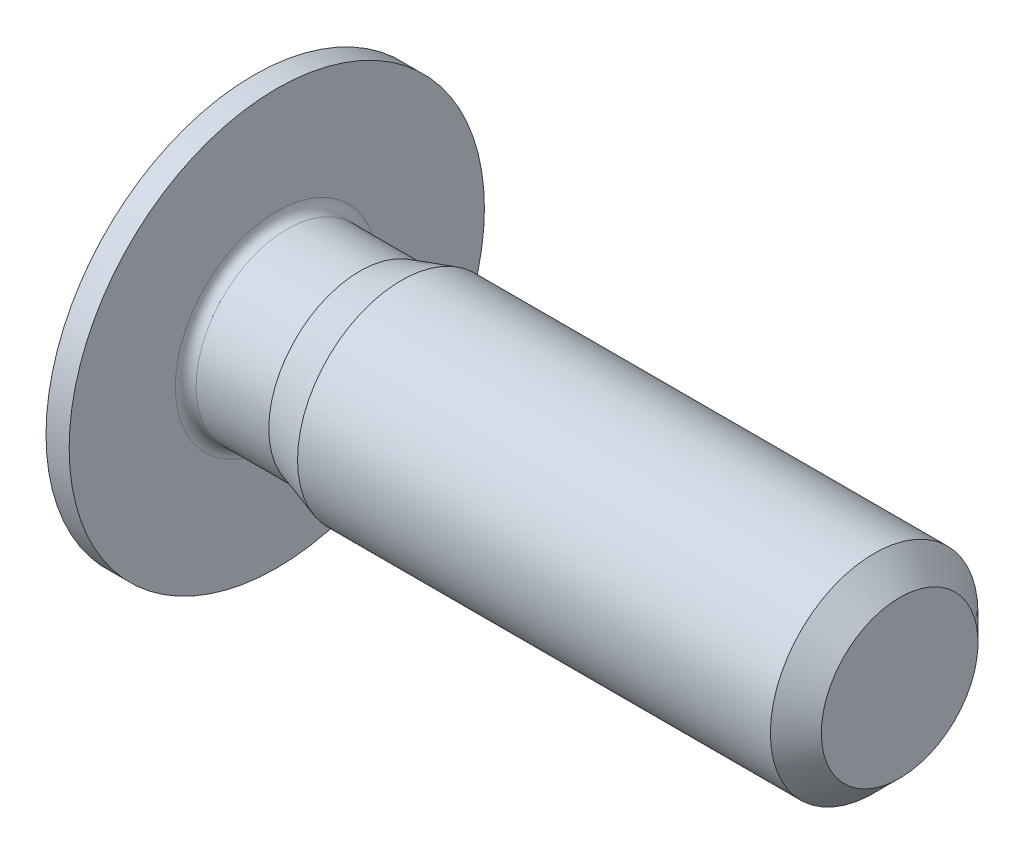
ISO-10303-21;
HEADER;
FILE_DESCRIPTION(('STEP AP214'),'2;1');
FILE_NAME('part.step','',(''),(''),'','','');
FILE_SCHEMA(('AUTOMOTIVE_DESIGN { 1 0 10303 214 1 1 1 1 }'));
ENDSEC;
DATA;
#1=APPLICATION_CONTEXT('core data for automotive mechanical design processes');
#2=APPLICATION_PROTOCOL_DEFINITION('international standard','automotive_design',2000,#1);
#3=PRODUCT_CONTEXT('',#1,'mechanical');
#4=PRODUCT('Part','Part','',(#3));
#5=PRODUCT_RELATED_PRODUCT_CATEGORY('part','',(#4));
#6=PRODUCT_DEFINITION_FORMATION('','',#4);
#7=PRODUCT_DEFINITION_CONTEXT('part definition',#1,'design');
#8=PRODUCT_DEFINITION('design','',#6,#7);
#9=PRODUCT_DEFINITION_SHAPE('','',#8);
#10=(LENGTH_UNIT() NAMED_UNIT(*) SI_UNIT(.MILLI.,.METRE.));
#11=(NAMED_UNIT(*) PLANE_ANGLE_UNIT() SI_UNIT($,.RADIAN.));
#12=(NAMED_UNIT(*) SI_UNIT($,.STERADIAN.) SOLID_ANGLE_UNIT());
#13=UNCERTAINTY_MEASURE_WITH_UNIT(LENGTH_MEASURE(1.E-05),#10,'distance_accuracy_value','');
#14=(GEOMETRIC_REPRESENTATION_CONTEXT(3) GLOBAL_UNCERTAINTY_ASSIGNED_CONTEXT((#13)) GLOBAL_UNIT_ASSIGNED_CONTEXT((#10,
#11,#12)) REPRESENTATION_CONTEXT('',''));
#15=CARTESIAN_POINT('',(0.,0.,0.));
#16=DIRECTION('',(0.,0.,1.));
#17=DIRECTION('',(1.,0.,0.));
#18=AXIS2_PLACEMENT_3D('',#15,#16,#17);
#19=CARTESIAN_POINT('',(-0.5,0.,0.));
#20=DIRECTION('',(1.,0.,0.));
#21=DIRECTION('',(0.,0.,-1.));
#22=AXIS2_PLACEMENT_3D('',#19,#20,#21);
#23=PLANE('',#22);
#24=CARTESIAN_POINT('',(-0.5,0.,0.));
#25=DIRECTION('',(-1.,0.,0.));
#26=DIRECTION('',(0.,0.,1.));
#27=AXIS2_PLACEMENT_3D('',#24,#25,#26);
#28=CIRCLE('',#27,1.52);
#29=CARTESIAN_POINT('',(-0.5,0.,1.52));
#30=VERTEX_POINT('',#29);
#31=EDGE_CURVE('E146',#30,#30,#28,.T.);
#32=ORIENTED_EDGE('',*,*,#31,.T.);
#33=EDGE_LOOP('',(#32));
#34=FACE_BOUND('',#33,.T.);
#35=DIRECTION('',(0.,0.499999999999993,-0.866025403784442));
#36=VECTOR('',#35,1.);
#37=CARTESIAN_POINT('',(-0.5,-0.75055534994651,0.));
#38=LINE('',#37,#36);
#39=CARTESIAN_POINT('',(-0.5,-0.75055534994651,0.));
#40=VERTEX_POINT('',#39);
#41=CARTESIAN_POINT('',(-0.5,-0.37527767497326,-0.65));
#42=VERTEX_POINT('',#41);
#43=EDGE_CURVE('E414',#40,#42,#38,.T.);
#44=ORIENTED_EDGE('',*,*,#43,.T.);
#45=DIRECTION('',(0.,1.,0.));
#46=VECTOR('',#45,1.);
#47=CARTESIAN_POINT('',(-0.5,-0.37527767497326,-0.65));
#48=LINE('',#47,#46);
#49=CARTESIAN_POINT('',(-0.5,0.37527767497326,-0.65));
#50=VERTEX_POINT('',#49);
#51=EDGE_CURVE('E416',#42,#50,#48,.T.);
#52=ORIENTED_EDGE('',*,*,#51,.T.);
#53=DIRECTION('',(0.,0.499999999999993,0.866025403784442));
#54=VECTOR('',#53,1.);
#55=CARTESIAN_POINT('',(-0.5,0.37527767497326,-0.65));
#56=LINE('',#55,#54);
#57=CARTESIAN_POINT('',(-0.5,0.75055534994651,0.));
#58=VERTEX_POINT('',#57);
#59=EDGE_CURVE('E418',#50,#58,#56,.T.);
#60=ORIENTED_EDGE('',*,*,#59,.T.);
#61=DIRECTION('',(0.,-0.499999999999993,0.866025403784442));
#62=VECTOR('',#61,1.);
#63=CARTESIAN_POINT('',(-0.5,0.75055534994651,0.));
#64=LINE('',#63,#62);
#65=CARTESIAN_POINT('',(-0.5,0.37527767497326,0.65));
#66=VERTEX_POINT('',#65);
#67=EDGE_CURVE('E120',#58,#66,#64,.T.);
#68=ORIENTED_EDGE('',*,*,#67,.T.);
#69=DIRECTION('',(0.,-1.,0.));
#70=VECTOR('',#69,1.);
#71=CARTESIAN_POINT('',(-0.5,0.37527767497326,0.65));
#72=LINE('',#71,#70);
#73=CARTESIAN_POINT('',(-0.5,-0.37527767497326,0.65));
#74=VERTEX_POINT('',#73);
#75=EDGE_CURVE('E411',#66,#74,#72,.T.);
#76=ORIENTED_EDGE('',*,*,#75,.T.);
#77=DIRECTION('',(0.,-0.499999999999993,-0.866025403784442));
#78=VECTOR('',#77,1.);
#79=CARTESIAN_POINT('',(-0.5,-0.37527767497326,0.65));
#80=LINE('',#79,#78);
#81=EDGE_CURVE('E135',#74,#40,#80,.T.);
#82=ORIENTED_EDGE('',*,*,#81,.T.);
#83=EDGE_LOOP('',(#44,#52,#60,#68,#76,#82));
#84=FACE_BOUND('',#83,.T.);
#85=ADVANCED_FACE('F36',(#34,#84),#23,.F.);
#86=CARTESIAN_POINT('',(6.,0.7545,0.));
#87=DIRECTION('',(-1.,0.,0.));
#88=DIRECTION('',(0.,0.,1.));
#89=AXIS2_PLACEMENT_3D('',#86,#87,#88);
#90=PLANE('',#89);
#91=CARTESIAN_POINT('',(6.,0.,0.));
#92=DIRECTION('',(-1.,0.,0.));
#93=DIRECTION('',(0.,0.,1.));
#94=AXIS2_PLACEMENT_3D('',#91,#92,#93);
#95=CIRCLE('',#94,0.7545);
#96=CARTESIAN_POINT('',(6.,0.,0.7545));
#97=VERTEX_POINT('',#96);
#98=EDGE_CURVE('E11',#97,#97,#95,.T.);
#99=ORIENTED_EDGE('',*,*,#98,.F.);
#100=EDGE_LOOP('',(#99));
#101=FACE_BOUND('',#100,.T.);
#102=ADVANCED_FACE('F38',(#101),#90,.F.);
#103=CARTESIAN_POINT('',(6.,0.,0.));
#104=DIRECTION('',(-1.,0.,0.));
#105=DIRECTION('',(0.,0.,1.));
#106=AXIS2_PLACEMENT_3D('',#103,#104,#105);
#107=CONICAL_SURFACE('',#106,0.7545,0.785398163397448);
#108=CARTESIAN_POINT('',(5.7545,0.,0.));
#109=DIRECTION('',(-1.,0.,0.));
#110=DIRECTION('',(0.,0.,1.));
#111=AXIS2_PLACEMENT_3D('',#108,#109,#110);
#112=CIRCLE('',#111,1.);
#113=CARTESIAN_POINT('',(5.7545,0.,1.));
#114=VERTEX_POINT('',#113);
#115=EDGE_CURVE('E44',#114,#114,#112,.T.);
#116=ORIENTED_EDGE('',*,*,#115,.F.);
#117=EDGE_LOOP('',(#116));
#118=FACE_BOUND('',#117,.T.);
#119=ORIENTED_EDGE('',*,*,#98,.T.);
#120=EDGE_LOOP('',(#119));
#121=FACE_BOUND('',#120,.T.);
#122=ADVANCED_FACE('F172',(#118,#121),#107,.T.);
#123=CARTESIAN_POINT('',(6.,0.,0.));
#124=DIRECTION('',(-1.,0.,0.));
#125=DIRECTION('',(0.,0.,1.));
#126=AXIS2_PLACEMENT_3D('',#123,#124,#125);
#127=CYLINDRICAL_SURFACE('',#126,1.);
#128=CARTESIAN_POINT('',(1.2,0.,0.));
#129=DIRECTION('',(-1.,0.,0.));
#130=DIRECTION('',(0.,0.,1.));
#131=AXIS2_PLACEMENT_3D('',#128,#129,#130);
#132=CIRCLE('',#131,1.);
#133=CARTESIAN_POINT('',(1.2,0.,1.));
#134=VERTEX_POINT('',#133);
#135=EDGE_CURVE('E165',#134,#134,#132,.T.);
#136=ORIENTED_EDGE('',*,*,#135,.F.);
#137=EDGE_LOOP('',(#136));
#138=FACE_BOUND('',#137,.T.);
#139=ORIENTED_EDGE('',*,*,#115,.T.);
#140=EDGE_LOOP('',(#139));
#141=FACE_BOUND('',#140,.T.);
#142=ADVANCED_FACE('F170',(#138,#141),#127,.T.);
#143=CARTESIAN_POINT('',(1.2,0.,0.));
#144=DIRECTION('',(1.,0.,0.));
#145=DIRECTION('',(0.,0.,-1.));
#146=AXIS2_PLACEMENT_3D('',#143,#144,#145);
#147=CONICAL_SURFACE('',#146,1.,0.297752138542791);
#148=CARTESIAN_POINT('',(0.8,0.,0.));
#149=DIRECTION('',(-1.,0.,0.));
#150=DIRECTION('',(0.,0.,1.));
#151=AXIS2_PLACEMENT_3D('',#148,#149,#150);
#152=CIRCLE('',#151,0.87725);
#153=CARTESIAN_POINT('',(0.8,0.,0.87725));
#154=VERTEX_POINT('',#153);
#155=EDGE_CURVE('E162',#154,#154,#152,.T.);
#156=ORIENTED_EDGE('',*,*,#155,.F.);
#157=EDGE_LOOP('',(#156));
#158=FACE_BOUND('',#157,.T.);
#159=ORIENTED_EDGE('',*,*,#135,.T.);
#160=EDGE_LOOP('',(#159));
#161=FACE_BOUND('',#160,.T.);
#162=ADVANCED_FACE('F209',(#158,#161),#147,.T.);
#163=CARTESIAN_POINT('',(6.,0.,0.));
#164=DIRECTION('',(-1.,0.,0.));
#165=DIRECTION('',(0.,0.,1.));
#166=AXIS2_PLACEMENT_3D('',#163,#164,#165);
#167=CYLINDRICAL_SURFACE('',#166,0.87725);
#168=CARTESIAN_POINT('',(0.1,0.,0.));
#169=DIRECTION('',(-1.,0.,0.));
#170=DIRECTION('',(0.,0.,1.));
#171=AXIS2_PLACEMENT_3D('',#168,#169,#170);
#172=CIRCLE('',#171,0.87725);
#173=CARTESIAN_POINT('',(0.1,0.,0.87725));
#174=VERTEX_POINT('',#173);
#175=EDGE_CURVE('E159',#174,#174,#172,.T.);
#176=ORIENTED_EDGE('',*,*,#175,.F.);
#177=EDGE_LOOP('',(#176));
#178=FACE_BOUND('',#177,.T.);
#179=ORIENTED_EDGE('',*,*,#155,.T.);
#180=EDGE_LOOP('',(#179));
#181=FACE_BOUND('',#180,.T.);
#182=ADVANCED_FACE('F205',(#178,#181),#167,.T.);
#183=CARTESIAN_POINT('',(0.0999999999999906,0.,0.));
#184=DIRECTION('',(-1.,0.,0.));
#185=DIRECTION('',(0.,0.,1.));
#186=AXIS2_PLACEMENT_3D('',#183,#184,#185);
#187=TOROIDAL_SURFACE('',#186,0.977249999999991,0.0999999999999907);
#188=CARTESIAN_POINT('',(0.,0.,0.));
#189=DIRECTION('',(-1.,0.,0.));
#190=DIRECTION('',(0.,0.,1.));
#191=AXIS2_PLACEMENT_3D('',#188,#189,#190);
#192=CIRCLE('',#191,0.97725);
#193=CARTESIAN_POINT('',(0.,0.,0.97725));
#194=VERTEX_POINT('',#193);
#195=EDGE_CURVE('E156',#194,#194,#192,.T.);
#196=ORIENTED_EDGE('',*,*,#195,.F.);
#197=EDGE_LOOP('',(#196));
#198=FACE_BOUND('',#197,.T.);
#199=ORIENTED_EDGE('',*,*,#175,.T.);
#200=EDGE_LOOP('',(#199));
#201=FACE_BOUND('',#200,.T.);
#202=ADVANCED_FACE('F201',(#198,#201),#187,.F.);
#203=CARTESIAN_POINT('',(0.,2.,0.));
#204=DIRECTION('',(-1.,0.,0.));
#205=DIRECTION('',(0.,0.,1.));
#206=AXIS2_PLACEMENT_3D('',#203,#204,#205);
#207=PLANE('',#206);
#208=CARTESIAN_POINT('',(0.,0.,0.));
#209=DIRECTION('',(-1.,0.,0.));
#210=DIRECTION('',(0.,0.,1.));
#211=AXIS2_PLACEMENT_3D('',#208,#209,#210);
#212=CIRCLE('',#211,2.);
#213=CARTESIAN_POINT('',(0.,0.,2.));
#214=VERTEX_POINT('',#213);
#215=EDGE_CURVE('E153',#214,#214,#212,.T.);
#216=ORIENTED_EDGE('',*,*,#215,.F.);
#217=EDGE_LOOP('',(#216));
#218=FACE_BOUND('',#217,.T.);
#219=ORIENTED_EDGE('',*,*,#195,.T.);
#220=EDGE_LOOP('',(#219));
#221=FACE_BOUND('',#220,.T.);
#222=ADVANCED_FACE('F197',(#218,#221),#207,.F.);
#223=CARTESIAN_POINT('',(6.,0.,0.));
#224=DIRECTION('',(-1.,0.,0.));
#225=DIRECTION('',(0.,0.,1.));
#226=AXIS2_PLACEMENT_3D('',#223,#224,#225);
#227=CYLINDRICAL_SURFACE('',#226,2.);
#228=CARTESIAN_POINT('',(-0.22287187078898,0.,0.));
#229=DIRECTION('',(-1.,0.,0.));
#230=DIRECTION('',(0.,0.,1.));
#231=AXIS2_PLACEMENT_3D('',#228,#229,#230);
#232=CIRCLE('',#231,2.);
#233=CARTESIAN_POINT('',(-0.22287187078898,0.,2.));
#234=VERTEX_POINT('',#233);
#235=EDGE_CURVE('E150',#234,#234,#232,.T.);
#236=ORIENTED_EDGE('',*,*,#235,.F.);
#237=EDGE_LOOP('',(#236));
#238=FACE_BOUND('',#237,.T.);
#239=ORIENTED_EDGE('',*,*,#215,.T.);
#240=EDGE_LOOP('',(#239));
#241=FACE_BOUND('',#240,.T.);
#242=ADVANCED_FACE('F193',(#238,#241),#227,.T.);
#243=CARTESIAN_POINT('',(-0.22287187078898,0.,0.));
#244=DIRECTION('',(1.,0.,0.));
#245=DIRECTION('',(0.,0.,-1.));
#246=AXIS2_PLACEMENT_3D('',#243,#244,#245);
#247=CONICAL_SURFACE('',#246,2.,1.0471975511966);
#248=ORIENTED_EDGE('',*,*,#31,.F.);
#249=EDGE_LOOP('',(#248));
#250=FACE_BOUND('',#249,.T.);
#251=ORIENTED_EDGE('',*,*,#235,.T.);
#252=EDGE_LOOP('',(#251));
#253=FACE_BOUND('',#252,.T.);
#254=ADVANCED_FACE('F190',(#250,#253),#247,.T.);
#255=CARTESIAN_POINT('',(0.7,0.37527767497326,0.65));
#256=DIRECTION('',(0.,0.,-1.));
#257=DIRECTION('',(-1.,0.,0.));
#258=AXIS2_PLACEMENT_3D('',#255,#256,#257);
#259=PLANE('',#258);
#260=DIRECTION('',(0.,-1.,0.));
#261=VECTOR('',#260,1.);
#262=CARTESIAN_POINT('',(0.7,0.37527767497326,0.65));
#263=LINE('',#262,#261);
#264=CARTESIAN_POINT('',(0.7,0.37527767497326,0.65));
#265=VERTEX_POINT('',#264);
#266=CARTESIAN_POINT('',(0.7,0.,0.65));
#267=VERTEX_POINT('',#266);
#268=EDGE_CURVE('E117',#265,#267,#263,.T.);
#269=ORIENTED_EDGE('',*,*,#268,.T.);
#270=CARTESIAN_POINT('',(0.7,-0.37527767497326,0.65));
#271=VERTEX_POINT('',#270);
#272=EDGE_CURVE('E109',#267,#271,#263,.T.);
#273=ORIENTED_EDGE('',*,*,#272,.T.);
#274=DIRECTION('',(-1.,0.,0.));
#275=VECTOR('',#274,1.);
#276=CARTESIAN_POINT('',(0.7,-0.37527767497326,0.65));
#277=LINE('',#276,#275);
#278=EDGE_CURVE('E114',#271,#74,#277,.T.);
#279=ORIENTED_EDGE('',*,*,#278,.T.);
#280=ORIENTED_EDGE('',*,*,#75,.F.);
#281=DIRECTION('',(-1.,0.,0.));
#282=VECTOR('',#281,1.);
#283=CARTESIAN_POINT('',(0.7,0.37527767497326,0.65));
#284=LINE('',#283,#282);
#285=EDGE_CURVE('E406',#265,#66,#284,.T.);
#286=ORIENTED_EDGE('',*,*,#285,.F.);
#287=EDGE_LOOP('',(#269,#273,#279,#280,#286));
#288=FACE_BOUND('',#287,.T.);
#289=ADVANCED_FACE('F111',(#288),#259,.T.);
#290=CARTESIAN_POINT('',(0.7,-0.37527767497326,0.65));
#291=DIRECTION('',(0.,0.866025403784443,-0.499999999999993));
#292=DIRECTION('',(0.,0.499999999999993,0.866025403784442));
#293=AXIS2_PLACEMENT_3D('',#290,#291,#292);
#294=PLANE('',#293);
#295=DIRECTION('',(0.,-0.499999999999993,-0.866025403784442));
#296=VECTOR('',#295,1.);
#297=CARTESIAN_POINT('',(0.7,-0.37527767497326,0.65));
#298=LINE('',#297,#296);
#299=CARTESIAN_POINT('',(0.7,-0.562916512459887,0.324999999999996));
#300=VERTEX_POINT('',#299);
#301=EDGE_CURVE('E123',#271,#300,#298,.T.);
#302=ORIENTED_EDGE('',*,*,#301,.T.);
#303=CARTESIAN_POINT('',(0.7,-0.75055534994651,0.));
#304=VERTEX_POINT('',#303);
#305=EDGE_CURVE('E130',#300,#304,#298,.T.);
#306=ORIENTED_EDGE('',*,*,#305,.T.);
#307=DIRECTION('',(-1.,0.,0.));
#308=VECTOR('',#307,1.);
#309=CARTESIAN_POINT('',(0.7,-0.75055534994651,0.));
#310=LINE('',#309,#308);
#311=EDGE_CURVE('E136',#304,#40,#310,.T.);
#312=ORIENTED_EDGE('',*,*,#311,.T.);
#313=ORIENTED_EDGE('',*,*,#81,.F.);
#314=ORIENTED_EDGE('',*,*,#278,.F.);
#315=EDGE_LOOP('',(#302,#306,#312,#313,#314));
#316=FACE_BOUND('',#315,.T.);
#317=ADVANCED_FACE('F133',(#316),#294,.T.);
#318=CARTESIAN_POINT('',(0.7,-0.75055534994651,0.));
#319=DIRECTION('',(0.,0.866025403784443,0.499999999999993));
#320=DIRECTION('',(0.,-0.499999999999993,0.866025403784442));
#321=AXIS2_PLACEMENT_3D('',#318,#319,#320);
#322=PLANE('',#321);
#323=DIRECTION('',(0.,0.499999999999993,-0.866025403784442));
#324=VECTOR('',#323,1.);
#325=CARTESIAN_POINT('',(0.7,-0.75055534994651,0.));
#326=LINE('',#325,#324);
#327=CARTESIAN_POINT('',(0.7,-0.562916512459879,-0.324999999999991));
#328=VERTEX_POINT('',#327);
#329=EDGE_CURVE('E51',#304,#328,#326,.T.);
#330=ORIENTED_EDGE('',*,*,#329,.T.);
#331=CARTESIAN_POINT('',(0.7,-0.37527767497326,-0.65));
#332=VERTEX_POINT('',#331);
#333=EDGE_CURVE('E129',#328,#332,#326,.T.);
#334=ORIENTED_EDGE('',*,*,#333,.T.);
#335=DIRECTION('',(-1.,0.,0.));
#336=VECTOR('',#335,1.);
#337=CARTESIAN_POINT('',(0.7,-0.37527767497326,-0.65));
#338=LINE('',#337,#336);
#339=EDGE_CURVE('E141',#332,#42,#338,.T.);
#340=ORIENTED_EDGE('',*,*,#339,.T.);
#341=ORIENTED_EDGE('',*,*,#43,.F.);
#342=ORIENTED_EDGE('',*,*,#311,.F.);
#343=EDGE_LOOP('',(#330,#334,#340,#341,#342));
#344=FACE_BOUND('',#343,.T.);
#345=ADVANCED_FACE('F257',(#344),#322,.T.);
#346=CARTESIAN_POINT('',(0.7,-0.37527767497326,-0.65));
#347=DIRECTION('',(0.,0.,1.));
#348=DIRECTION('',(1.,0.,0.));
#349=AXIS2_PLACEMENT_3D('',#346,#347,#348);
#350=PLANE('',#349);
#351=DIRECTION('',(0.,1.,0.));
#352=VECTOR('',#351,1.);
#353=CARTESIAN_POINT('',(0.7,-0.37527767497326,-0.65));
#354=LINE('',#353,#352);
#355=CARTESIAN_POINT('',(0.7,0.,-0.65));
#356=VERTEX_POINT('',#355);
#357=EDGE_CURVE('E436',#332,#356,#354,.T.);
#358=ORIENTED_EDGE('',*,*,#357,.T.);
#359=CARTESIAN_POINT('',(0.7,0.37527767497326,-0.65));
#360=VERTEX_POINT('',#359);
#361=EDGE_CURVE('E434',#356,#360,#354,.T.);
#362=ORIENTED_EDGE('',*,*,#361,.T.);
#363=DIRECTION('',(-1.,0.,0.));
#364=VECTOR('',#363,1.);
#365=CARTESIAN_POINT('',(0.7,0.37527767497326,-0.65));
#366=LINE('',#365,#364);
#367=EDGE_CURVE('E422',#360,#50,#366,.T.);
#368=ORIENTED_EDGE('',*,*,#367,.T.);
#369=ORIENTED_EDGE('',*,*,#51,.F.);
#370=ORIENTED_EDGE('',*,*,#339,.F.);
#371=EDGE_LOOP('',(#358,#362,#368,#369,#370));
#372=FACE_BOUND('',#371,.T.);
#373=ADVANCED_FACE('F264',(#372),#350,.T.);
#374=CARTESIAN_POINT('',(0.7,0.37527767497326,-0.65));
#375=DIRECTION('',(0.,-0.866025403784443,0.499999999999993));
#376=DIRECTION('',(0.,-0.499999999999993,-0.866025403784442));
#377=AXIS2_PLACEMENT_3D('',#374,#375,#376);
#378=PLANE('',#377);
#379=DIRECTION('',(0.,0.499999999999993,0.866025403784442));
#380=VECTOR('',#379,1.);
#381=CARTESIAN_POINT('',(0.7,0.37527767497326,-0.65));
#382=LINE('',#381,#380);
#383=CARTESIAN_POINT('',(0.7,0.562916512459887,-0.324999999999996));
#384=VERTEX_POINT('',#383);
#385=EDGE_CURVE('E398',#360,#384,#382,.T.);
#386=ORIENTED_EDGE('',*,*,#385,.T.);
#387=CARTESIAN_POINT('',(0.7,0.75055534994651,0.));
#388=VERTEX_POINT('',#387);
#389=EDGE_CURVE('E437',#384,#388,#382,.T.);
#390=ORIENTED_EDGE('',*,*,#389,.T.);
#391=DIRECTION('',(-1.,0.,0.));
#392=VECTOR('',#391,1.);
#393=CARTESIAN_POINT('',(0.7,0.75055534994651,0.));
#394=LINE('',#393,#392);
#395=EDGE_CURVE('E404',#388,#58,#394,.T.);
#396=ORIENTED_EDGE('',*,*,#395,.T.);
#397=ORIENTED_EDGE('',*,*,#59,.F.);
#398=ORIENTED_EDGE('',*,*,#367,.F.);
#399=EDGE_LOOP('',(#386,#390,#396,#397,#398));
#400=FACE_BOUND('',#399,.T.);
#401=ADVANCED_FACE('F271',(#400),#378,.T.);
#402=CARTESIAN_POINT('',(0.7,0.75055534994651,0.));
#403=DIRECTION('',(0.,-0.866025403784443,-0.499999999999993));
#404=DIRECTION('',(0.,0.499999999999993,-0.866025403784442));
#405=AXIS2_PLACEMENT_3D('',#402,#403,#404);
#406=PLANE('',#405);
#407=DIRECTION('',(0.,-0.499999999999993,0.866025403784442));
#408=VECTOR('',#407,1.);
#409=CARTESIAN_POINT('',(0.7,0.75055534994651,0.));
#410=LINE('',#409,#408);
#411=CARTESIAN_POINT('',(0.7,0.562916512459887,0.324999999999996));
#412=VERTEX_POINT('',#411);
#413=EDGE_CURVE('E397',#388,#412,#410,.T.);
#414=ORIENTED_EDGE('',*,*,#413,.T.);
#415=EDGE_CURVE('E394',#412,#265,#410,.T.);
#416=ORIENTED_EDGE('',*,*,#415,.T.);
#417=ORIENTED_EDGE('',*,*,#285,.T.);
#418=ORIENTED_EDGE('',*,*,#67,.F.);
#419=ORIENTED_EDGE('',*,*,#395,.F.);
#420=EDGE_LOOP('',(#414,#416,#417,#418,#419));
#421=FACE_BOUND('',#420,.T.);
#422=ADVANCED_FACE('F279',(#421),#406,.T.);
#423=CARTESIAN_POINT('',(0.7,0.,0.));
#424=DIRECTION('',(1.,0.,0.));
#425=DIRECTION('',(0.,0.,-1.));
#426=AXIS2_PLACEMENT_3D('',#423,#424,#425);
#427=PLANE('',#426);
#428=CARTESIAN_POINT('',(0.7,0.,0.));
#429=DIRECTION('',(-1.,0.,0.));
#430=DIRECTION('',(0.,0.,1.));
#431=AXIS2_PLACEMENT_3D('',#428,#429,#430);
#432=CIRCLE('',#431,0.64999999999999);
#433=EDGE_CURVE('E441',#384,#356,#432,.T.);
#434=ORIENTED_EDGE('',*,*,#433,.F.);
#435=ORIENTED_EDGE('',*,*,#385,.F.);
#436=ORIENTED_EDGE('',*,*,#361,.F.);
#437=EDGE_LOOP('',(#434,#435,#436));
#438=FACE_BOUND('',#437,.T.);
#439=ADVANCED_FACE('F287',(#438),#427,.F.);
#440=EDGE_CURVE('E147',#412,#384,#432,.T.);
#441=ORIENTED_EDGE('',*,*,#440,.F.);
#442=ORIENTED_EDGE('',*,*,#413,.F.);
#443=ORIENTED_EDGE('',*,*,#389,.F.);
#444=EDGE_LOOP('',(#441,#442,#443));
#445=FACE_BOUND('',#444,.T.);
#446=ADVANCED_FACE('F295',(#445),#427,.F.);
#447=EDGE_CURVE('E140',#267,#412,#432,.T.);
#448=ORIENTED_EDGE('',*,*,#447,.F.);
#449=ORIENTED_EDGE('',*,*,#268,.F.);
#450=ORIENTED_EDGE('',*,*,#415,.F.);
#451=EDGE_LOOP('',(#448,#449,#450));
#452=FACE_BOUND('',#451,.T.);
#453=ADVANCED_FACE('F304',(#452),#427,.F.);
#454=EDGE_CURVE('E125',#300,#267,#432,.T.);
#455=ORIENTED_EDGE('',*,*,#454,.F.);
#456=ORIENTED_EDGE('',*,*,#301,.F.);
#457=ORIENTED_EDGE('',*,*,#272,.F.);
#458=EDGE_LOOP('',(#455,#456,#457));
#459=FACE_BOUND('',#458,.T.);
#460=ADVANCED_FACE('F124',(#459),#427,.F.);
#461=EDGE_CURVE('E138',#328,#300,#432,.T.);
#462=ORIENTED_EDGE('',*,*,#461,.F.);
#463=ORIENTED_EDGE('',*,*,#329,.F.);
#464=ORIENTED_EDGE('',*,*,#305,.F.);
#465=EDGE_LOOP('',(#462,#463,#464));
#466=FACE_BOUND('',#465,.T.);
#467=ADVANCED_FACE('F317',(#466),#427,.F.);
#468=EDGE_CURVE('E442',#356,#328,#432,.T.);
#469=ORIENTED_EDGE('',*,*,#468,.F.);
#470=ORIENTED_EDGE('',*,*,#357,.F.);
#471=ORIENTED_EDGE('',*,*,#333,.F.);
#472=EDGE_LOOP('',(#469,#470,#471));
#473=FACE_BOUND('',#472,.T.);
#474=ADVANCED_FACE('F298',(#473),#427,.F.);
#475=CARTESIAN_POINT('',(1.0752776749733,0.,0.));
#476=DIRECTION('',(-1.,0.,0.));
#477=DIRECTION('',(0.,0.,1.));
#478=AXIS2_PLACEMENT_3D('',#475,#476,#477);
#479=CONICAL_SURFACE('',#478,0.,1.04719755119654);
#480=ORIENTED_EDGE('',*,*,#447,.T.);
#481=ORIENTED_EDGE('',*,*,#440,.T.);
#482=ORIENTED_EDGE('',*,*,#433,.T.);
#483=ORIENTED_EDGE('',*,*,#468,.T.);
#484=ORIENTED_EDGE('',*,*,#461,.T.);
#485=ORIENTED_EDGE('',*,*,#454,.T.);
#486=EDGE_LOOP('',(#480,#481,#482,#483,#484,#485));
#487=FACE_BOUND('',#486,.T.);
#488=CARTESIAN_POINT('',(1.0752776749733,0.,0.));
#489=VERTEX_POINT('',#488);
#490=VERTEX_LOOP('',#489);
#491=FACE_BOUND('',#490,.T.);
#492=ADVANCED_FACE('F188',(#487,#491),#479,.F.);
#493=CLOSED_SHELL('',(#85,#102,#122,#142,#162,#182,#202,#222,#242,#254,#289,#317,#345,#373,#401,
#422,#439,#446,#453,#460,#467,#474,#492));
#494=MANIFOLD_SOLID_BREP('B2',#493);
#495=ADVANCED_BREP_SHAPE_REPRESENTATION('',(#18,#494),#14);
#496=SHAPE_DEFINITION_REPRESENTATION(#9,#495);
ENDSEC;
END-ISO-10303-21;
